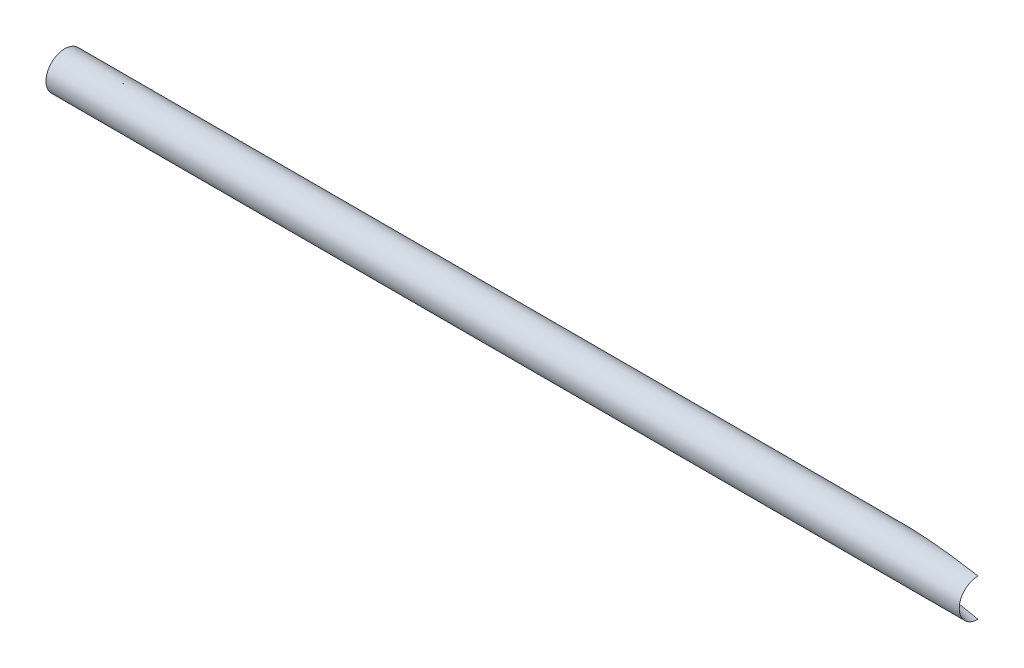
ISO-10303-21;
HEADER;
FILE_DESCRIPTION(('STEP AP214'),'2;1');
FILE_NAME('part.step','',(''),(''),'','','');
FILE_SCHEMA(('AUTOMOTIVE_DESIGN { 1 0 10303 214 1 1 1 1 }'));
ENDSEC;
DATA;
#1=APPLICATION_CONTEXT('core data for automotive mechanical design processes');
#2=APPLICATION_PROTOCOL_DEFINITION('international standard','automotive_design',2000,#1);
#3=PRODUCT_CONTEXT('',#1,'mechanical');
#4=PRODUCT('Part','Part','',(#3));
#5=PRODUCT_RELATED_PRODUCT_CATEGORY('part','',(#4));
#6=PRODUCT_DEFINITION_FORMATION('','',#4);
#7=PRODUCT_DEFINITION_CONTEXT('part definition',#1,'design');
#8=PRODUCT_DEFINITION('design','',#6,#7);
#9=PRODUCT_DEFINITION_SHAPE('','',#8);
#10=(LENGTH_UNIT() NAMED_UNIT(*) SI_UNIT(.MILLI.,.METRE.));
#11=(NAMED_UNIT(*) PLANE_ANGLE_UNIT() SI_UNIT($,.RADIAN.));
#12=(NAMED_UNIT(*) SI_UNIT($,.STERADIAN.) SOLID_ANGLE_UNIT());
#13=UNCERTAINTY_MEASURE_WITH_UNIT(LENGTH_MEASURE(1.E-05),#10,'distance_accuracy_value','');
#14=(GEOMETRIC_REPRESENTATION_CONTEXT(3) GLOBAL_UNCERTAINTY_ASSIGNED_CONTEXT((#13)) GLOBAL_UNIT_ASSIGNED_CONTEXT((#10,
#11,#12)) REPRESENTATION_CONTEXT('',''));
#15=CARTESIAN_POINT('',(0.,0.,0.));
#16=DIRECTION('',(0.,0.,1.));
#17=DIRECTION('',(1.,0.,0.));
#18=AXIS2_PLACEMENT_3D('',#15,#16,#17);
#19=CARTESIAN_POINT('',(-231.775,0.,0.));
#20=DIRECTION('',(1.,0.,0.));
#21=DIRECTION('',(0.,1.,0.));
#22=AXIS2_PLACEMENT_3D('',#19,#20,#21);
#23=CYLINDRICAL_SURFACE('',#22,6.35);
#24=CARTESIAN_POINT('',(208.553530062177,6.34999999999989,0.));
#25=CARTESIAN_POINT('',(208.215111386807,6.35000078555549,-0.103465426715095));
#26=CARTESIAN_POINT('',(207.876058761191,6.3474782800462,-0.204865751355623));
#27=CARTESIAN_POINT('',(207.196928731881,6.33791978798183,-0.403965797510251));
#28=CARTESIAN_POINT('',(206.856851295792,6.33088365723025,-0.501665400692021));
#29=CARTESIAN_POINT('',(205.835203576515,6.30364904131872,-0.78984585762347));
#30=CARTESIAN_POINT('',(205.152387117761,6.27732478872614,-0.975357080073032));
#31=CARTESIAN_POINT('',(203.784544449044,6.21063709607748,-1.33566173078402));
#32=CARTESIAN_POINT('',(203.099517916547,6.17027150566409,-1.51045351259361));
#33=CARTESIAN_POINT('',(201.727207997285,6.07667127703515,-1.85144959838024));
#34=CARTESIAN_POINT('',(201.039922800816,6.02341896307331,-2.0176417235045));
#35=CARTESIAN_POINT('',(199.664812168527,5.90461056899207,-2.34264628164214));
#36=CARTESIAN_POINT('',(198.976986853294,5.83905672209981,-2.50146004760852));
#37=CARTESIAN_POINT('',(197.601279340979,5.69557296558897,-2.81289014469089));
#38=CARTESIAN_POINT('',(196.913397152719,5.61764403672664,-2.9655069657277));
#39=CARTESIAN_POINT('',(195.7118508222,5.4700931177364,-3.22755312929091));
#40=CARTESIAN_POINT('',(195.198086424822,5.40334799922026,-3.33815057343866));
#41=CARTESIAN_POINT('',(194.171049467578,5.26207264819454,-3.55668825093245));
#42=CARTESIAN_POINT('',(193.657776916258,5.18754228278977,-3.6646284388799));
#43=CARTESIAN_POINT('',(192.632411894139,5.03002130189547,-3.87800998535029));
#44=CARTESIAN_POINT('',(192.120318831606,4.94703697848666,-3.98345313135596));
#45=CARTESIAN_POINT('',(191.097333574582,4.77151891798964,-4.19210013957637));
#46=CARTESIAN_POINT('',(190.586441319573,4.67898567318155,-4.2953041168964));
#47=CARTESIAN_POINT('',(189.565739092911,4.4827555224113,-4.49972279070746));
#48=CARTESIAN_POINT('',(189.055931144401,4.37904540683842,-4.60093496238986));
#49=CARTESIAN_POINT('',(188.038629986027,4.15837713352067,-4.80132095822046));
#50=CARTESIAN_POINT('',(187.531137292692,4.04141615676668,-4.90049434331215));
#51=CARTESIAN_POINT('',(186.772184361729,3.85344026252207,-5.04775297355612));
#52=CARTESIAN_POINT('',(186.51933962384,3.78862434846896,-5.09663511066775));
#53=CARTESIAN_POINT('',(186.014814276636,3.65423122445971,-5.19384111362586));
#54=CARTESIAN_POINT('',(185.76313362632,3.58465418357939,-5.24216499922566));
#55=CARTESIAN_POINT('',(185.261354987358,3.44001489441667,-5.33819531347796));
#56=CARTESIAN_POINT('',(185.011256344697,3.3649550990723,-5.38590200714748));
#57=CARTESIAN_POINT('',(184.512990099929,3.20832340328169,-5.48065263291774));
#58=CARTESIAN_POINT('',(184.264822317197,3.12675212019959,-5.52769662735362));
#59=CARTESIAN_POINT('',(183.852613953651,2.98394298390246,-5.6056070902747));
#60=CARTESIAN_POINT('',(183.68785784789,2.92488703347537,-5.63668513472672));
#61=CARTESIAN_POINT('',(183.359766950683,2.80264255240938,-5.69845513106541));
#62=CARTESIAN_POINT('',(183.19643245219,2.73945319181308,-5.72914700392748));
#63=CARTESIAN_POINT('',(182.871499160061,2.6081745301855,-5.79009245690659));
#64=CARTESIAN_POINT('',(182.709901805071,2.54008148083065,-5.82034568004314));
#65=CARTESIAN_POINT('',(182.389572803497,2.39823813965368,-5.88020983449781));
#66=CARTESIAN_POINT('',(182.230835008478,2.32450239946409,-5.90982218106626));
#67=CARTESIAN_POINT('',(181.916781318134,2.16993596384478,-5.96830998584013));
#68=CARTESIAN_POINT('',(181.761463461379,2.08910947514268,-5.99718586801651));
#69=CARTESIAN_POINT('',(181.532214764237,1.96113712356149,-6.03973885119984));
#70=CARTESIAN_POINT('',(181.456457970442,1.91738185557328,-6.05378932550491));
#71=CARTESIAN_POINT('',(181.306444444814,1.82728850930841,-6.08159051439045));
#72=CARTESIAN_POINT('',(181.232187538273,1.78095073423593,-6.09534126389806));
#73=CARTESIAN_POINT('',(181.083684530527,1.68409349873041,-6.12282022107892));
#74=CARTESIAN_POINT('',(181.00948606067,1.63349798658045,-6.13653908973142));
#75=CARTESIAN_POINT('',(180.863582024246,1.52864255094516,-6.16349616315376));
#76=CARTESIAN_POINT('',(180.791877173578,1.47438158808254,-6.17673422993704));
#77=CARTESIAN_POINT('',(180.651972211042,1.36171327952483,-6.20254547100456));
#78=CARTESIAN_POINT('',(180.583763366739,1.30331722964999,-6.21512030447346));
#79=CARTESIAN_POINT('',(180.451835679599,1.18148867033477,-6.23942664173118));
#80=CARTESIAN_POINT('',(180.388113999395,1.11805939851816,-6.2511586785418));
#81=CARTESIAN_POINT('',(180.297119225817,1.01834918707555,-6.26790248781666));
#82=CARTESIAN_POINT('',(180.267497916404,0.984279022639341,-6.27335136930902));
#83=CARTESIAN_POINT('',(180.210153872524,0.914539881218017,-6.28389700639921));
#84=CARTESIAN_POINT('',(180.182430351373,0.878871576975029,-6.28899390791016));
#85=CARTESIAN_POINT('',(180.129261205338,0.805850502368725,-6.29876647743572));
#86=CARTESIAN_POINT('',(180.103813765176,0.768499110753451,-6.30344248115476));
#87=CARTESIAN_POINT('',(180.055593762884,0.691985877202522,-6.31230100116032));
#88=CARTESIAN_POINT('',(180.032824991478,0.652821576318626,-6.31648281813398));
#89=CARTESIAN_POINT('',(179.97690689475,0.546885126533149,-6.32675102540611));
#90=CARTESIAN_POINT('',(179.946489975355,0.478545598324101,-6.33233430553032));
#91=CARTESIAN_POINT('',(179.909448484317,0.373024449559518,-6.33913226777076));
#92=CARTESIAN_POINT('',(179.89853513121,0.337366484457501,-6.34113484897082));
#93=CARTESIAN_POINT('',(179.879858755754,0.265214448512127,-6.3445616719974));
#94=CARTESIAN_POINT('',(179.87209401388,0.228720845564879,-6.34598622949544));
#95=CARTESIAN_POINT('',(179.859905118846,0.154773881983051,-6.3482223687043));
#96=CARTESIAN_POINT('',(179.855515930237,0.117314523546568,-6.34902753467582));
#97=CARTESIAN_POINT('',(179.850371429492,0.0421528981023721,-6.34997125034164));
#98=CARTESIAN_POINT('',(179.849614520809,0.00445074511199243,-6.35011009291466));
#99=CARTESIAN_POINT('',(179.851761471558,-0.070863391740095,-6.34971625866019));
#100=CARTESIAN_POINT('',(179.854667007041,-0.108475326420959,-6.34918327438327));
#101=CARTESIAN_POINT('',(179.864026992056,-0.183230582651983,-6.34746619162846));
#102=CARTESIAN_POINT('',(179.870481551296,-0.22037388967952,-6.34628207302258));
#103=CARTESIAN_POINT('',(179.892689093257,-0.32087256182981,-6.3422076182153));
#104=CARTESIAN_POINT('',(179.911789836192,-0.38348115791637,-6.33870284213501));
#105=CARTESIAN_POINT('',(179.958344286159,-0.505314381942772,-6.3301582944103));
#106=CARTESIAN_POINT('',(179.985800128355,-0.564538140278695,-6.32511813039354));
#107=CARTESIAN_POINT('',(180.044045290627,-0.673224126954049,-6.31442226737286));
#108=CARTESIAN_POINT('',(180.0741773366,-0.723057020933218,-6.30888760592636));
#109=CARTESIAN_POINT('',(180.138649517881,-0.819847875128244,-6.29704133583411));
#110=CARTESIAN_POINT('',(180.172992720438,-0.866803702013715,-6.29072916086079));
#111=CARTESIAN_POINT('',(180.24510515146,-0.958125120364277,-6.2774701857078));
#112=CARTESIAN_POINT('',(180.282884623192,-1.00248227332031,-6.27052148762996));
#113=CARTESIAN_POINT('',(180.361087613239,-1.08867819691548,-6.25613201153702));
#114=CARTESIAN_POINT('',(180.401510518112,-1.13051754754577,-6.24869134768449));
#115=CARTESIAN_POINT('',(180.497640957452,-1.22484886712473,-6.23098905730348));
#116=CARTESIAN_POINT('',(180.554131534664,-1.27651312583452,-6.22058091386216));
#117=CARTESIAN_POINT('',(180.66994536401,-1.37646580943263,-6.19922998529391));
#118=CARTESIAN_POINT('',(180.729269880572,-1.42475270330098,-6.18828696146597));
#119=CARTESIAN_POINT('',(180.850204826126,-1.5184513737772,-6.16596533344779));
#120=CARTESIAN_POINT('',(180.911818579952,-1.56385868685133,-6.15458609488268));
#121=CARTESIAN_POINT('',(181.0368058677,-1.65210024929482,-6.13148765228088));
#122=CARTESIAN_POINT('',(181.100179712797,-1.69493403938943,-6.11976838811283));
#123=CARTESIAN_POINT('',(181.293045970806,-1.82046792897507,-6.08407911327544));
#124=CARTESIAN_POINT('',(181.42468719791,-1.89975085571623,-6.05968758455828));
#125=CARTESIAN_POINT('',(181.691680819162,-2.05108666729656,-6.0101460064837));
#126=CARTESIAN_POINT('',(181.827029406705,-2.12314663845513,-5.98499673268457));
#127=CARTESIAN_POINT('',(182.093636249543,-2.25800933976115,-5.93538440982276));
#128=CARTESIAN_POINT('',(182.224757382951,-2.321095479572,-5.91095055516344));
#129=CARTESIAN_POINT('',(182.488931481566,-2.4429215265248,-5.86165077046332));
#130=CARTESIAN_POINT('',(182.621984675269,-2.50166091450375,-5.83678478924717));
#131=CARTESIAN_POINT('',(182.889776082891,-2.61551406178947,-5.78666221530445));
#132=CARTESIAN_POINT('',(183.024516353641,-2.67062274924148,-5.76140513457991));
#133=CARTESIAN_POINT('',(183.295211134929,-2.77763038275133,-5.71058413540296));
#134=CARTESIAN_POINT('',(183.431165710761,-2.82952915500938,-5.68502020042535));
#135=CARTESIAN_POINT('',(183.840929952895,-2.98118688448416,-5.60784707674638));
#136=CARTESIAN_POINT('',(184.116225060233,-3.07673410074653,-5.55583423417862));
#137=CARTESIAN_POINT('',(184.669613820141,-3.25898361580898,-5.45092191816286));
#138=CARTESIAN_POINT('',(184.947708256641,-3.34568335671281,-5.3980221934257));
#139=CARTESIAN_POINT('',(185.506476472726,-3.51196629549083,-5.29134828818123));
#140=CARTESIAN_POINT('',(185.787154343228,-3.59153468513061,-5.2375725501371));
#141=CARTESIAN_POINT('',(186.34968218265,-3.74441675754034,-5.12938536735158));
#142=CARTESIAN_POINT('',(186.631530213999,-3.81773824357077,-5.07497481517678));
#143=CARTESIAN_POINT('',(187.196225292739,-3.95904778031087,-4.96552313788517));
#144=CARTESIAN_POINT('',(187.479071541364,-4.0270393825501,-4.91048246116117));
#145=CARTESIAN_POINT('',(188.045640326154,-4.15838105973275,-4.79976430119458));
#146=CARTESIAN_POINT('',(188.329362645865,-4.22173219838667,-4.7440869672941));
#147=CARTESIAN_POINT('',(189.008533822952,-4.36826932955958,-4.61021326502418));
#148=CARTESIAN_POINT('',(189.404337073351,-4.44953772168821,-4.53171535971061));
#149=CARTESIAN_POINT('',(190.197048810002,-4.60518750532968,-4.37344893228518));
#150=CARTESIAN_POINT('',(190.593957333701,-4.679568660497,-4.29368036667879));
#151=CARTESIAN_POINT('',(191.388886511878,-4.82227140859363,-4.13276819188909));
#152=CARTESIAN_POINT('',(191.786907758751,-4.89058862942106,-4.05162364002473));
#153=CARTESIAN_POINT('',(192.58357654463,-5.02169189103795,-3.88794151709335));
#154=CARTESIAN_POINT('',(192.982224093698,-5.08447784202651,-3.80540392343603));
#155=CARTESIAN_POINT('',(194.179413971063,-5.26532959553519,-3.55545106769412));
#156=CARTESIAN_POINT('',(194.978648882038,-5.37579120772544,-3.38580766573746));
#157=CARTESIAN_POINT('',(196.578196089011,-5.57888539106114,-3.03953750623384));
#158=CARTESIAN_POINT('',(197.378508691732,-5.67151066139514,-2.86290792459468));
#159=CARTESIAN_POINT('',(198.977478252362,-5.83982730811565,-2.50170746835639));
#160=CARTESIAN_POINT('',(199.776135416373,-5.91555111649346,-2.31715262759666));
#161=CARTESIAN_POINT('',(201.372088010371,-6.05036782896653,-1.93805403597373));
#162=CARTESIAN_POINT('',(202.169383918002,-6.10946892587518,-1.74351526198301));
#163=CARTESIAN_POINT('',(203.363555549513,-6.18488061934896,-1.44235951756058));
#164=CARTESIAN_POINT('',(203.761208443696,-6.20780671252412,-1.34044560433851));
#165=CARTESIAN_POINT('',(204.55583387115,-6.24898309242,-1.13309189391542));
#166=CARTESIAN_POINT('',(204.952806415084,-6.26723345309763,-1.02765215251288));
#167=CARTESIAN_POINT('',(205.745753340154,-6.29869664890781,-0.81283709506555));
#168=CARTESIAN_POINT('',(206.141728000766,-6.31191109900878,-0.703463053048131));
#169=CARTESIAN_POINT('',(206.932547883366,-6.33280606628607,-0.4802293947303));
#170=CARTESIAN_POINT('',(207.327393124592,-6.34048667829269,-0.366369855330634));
#171=CARTESIAN_POINT('',(208.28947223648,-6.35169414744168,-0.0822372991516372));
#172=CARTESIAN_POINT('',(208.855954513056,-6.35189639267594,0.0907742771525044));
#173=CARTESIAN_POINT('',(209.702563940456,-6.34042777726783,0.359845270985489));
#174=CARTESIAN_POINT('',(209.984293537083,-6.33464101397099,0.45114346051996));
#175=CARTESIAN_POINT('',(210.54646491241,-6.31863623548181,0.637238295917982));
#176=CARTESIAN_POINT('',(210.82690673547,-6.30841837410482,0.732034820240423));
#177=CARTESIAN_POINT('',(211.385847905554,-6.28297285282653,0.925332668354423));
#178=CARTESIAN_POINT('',(211.664349420176,-6.26775221709241,1.02382862717244));
#179=CARTESIAN_POINT('',(212.219449239092,-6.23155665259333,1.22501058016105));
#180=CARTESIAN_POINT('',(212.496047651376,-6.21058205314366,1.32769633425182));
#181=CARTESIAN_POINT('',(213.046819912702,-6.16196969230518,1.53760701879979));
#182=CARTESIAN_POINT('',(213.320994626441,-6.1343344156342,1.64483024431778));
#183=CARTESIAN_POINT('',(213.866434409865,-6.07126005927103,1.86422426004564));
#184=CARTESIAN_POINT('',(214.137699778098,-6.03582178849216,1.97639453644615));
#185=CARTESIAN_POINT('',(214.683577856437,-5.95468952753464,2.20901448998921));
#186=CARTESIAN_POINT('',(214.958096168042,-5.90875437483536,2.32960315616993));
#187=CARTESIAN_POINT('',(215.502313562413,-5.80527056261903,2.57668054599995));
#188=CARTESIAN_POINT('',(215.772012253689,-5.74772096430216,2.70316974595565));
#189=CARTESIAN_POINT('',(216.305169273666,-5.61864225232948,2.96214465202205));
#190=CARTESIAN_POINT('',(216.568627488808,-5.54711288449716,3.09463046712798));
#191=CARTESIAN_POINT('',(217.087372181763,-5.38718640409342,3.36533076011014));
#192=CARTESIAN_POINT('',(217.342660914771,-5.2987939943173,3.5035436324219));
#193=CARTESIAN_POINT('',(217.778289465893,-5.1270154702325,3.7486607628024));
#194=CARTESIAN_POINT('',(217.96102884193,-5.04818150542292,3.8544819847875));
#195=CARTESIAN_POINT('',(218.319301741015,-4.87767261607161,4.0681072359221));
#196=CARTESIAN_POINT('',(218.494834724427,-4.78599673214762,4.17591141268918));
#197=CARTESIAN_POINT('',(218.836749495559,-4.5883143783183,4.39218588309298));
#198=CARTESIAN_POINT('',(219.003146400799,-4.48233265138888,4.50065472458707));
#199=CARTESIAN_POINT('',(219.325130279914,-4.2543186683316,4.71677028106653));
#200=CARTESIAN_POINT('',(219.480722022691,-4.13229356270371,4.82441733983556));
#201=CARTESIAN_POINT('',(219.733229375153,-3.9108715587629,5.00412055250464));
#202=CARTESIAN_POINT('',(219.83352910052,-3.81597892472311,5.07698639764107));
#203=CARTESIAN_POINT('',(220.027029863083,-3.61751113698851,5.220257190167));
#204=CARTESIAN_POINT('',(220.120232781202,-3.51393829927237,5.29066278692035));
#205=CARTESIAN_POINT('',(220.298639210098,-3.29802875106883,5.42787745494789));
#206=CARTESIAN_POINT('',(220.383848358742,-3.18569832111379,5.49468904660685));
#207=CARTESIAN_POINT('',(220.545470207413,-2.9522963836697,5.62354017423035));
#208=CARTESIAN_POINT('',(220.621884180422,-2.83122614528766,5.6855804003531));
#209=CARTESIAN_POINT('',(220.754128316951,-2.59986087974894,5.79456508432719));
#210=CARTESIAN_POINT('',(220.811319512595,-2.49074681761677,5.84236756878969));
#211=CARTESIAN_POINT('',(220.918302390313,-2.2669042233321,5.93280786834791));
#212=CARTESIAN_POINT('',(220.968095437278,-2.1521767320105,5.97544663583287));
#213=CARTESIAN_POINT('',(221.059851429921,-1.91764572794419,6.05478798966892));
#214=CARTESIAN_POINT('',(221.101814744032,-1.79784245436852,6.09149085532588));
#215=CARTESIAN_POINT('',(221.177535617744,-1.55385714968122,6.15824831594412));
#216=CARTESIAN_POINT('',(221.211293050248,-1.4296750507822,6.18830280793135));
#217=CARTESIAN_POINT('',(221.270422299942,-1.17721463250369,6.24126381762115));
#218=CARTESIAN_POINT('',(221.295755639499,-1.04892037467842,6.2641375106569));
#219=CARTESIAN_POINT('',(221.337587867146,-0.789753019367523,6.30205841929722));
#220=CARTESIAN_POINT('',(221.354086653592,-0.658879892228955,6.31710554485397));
#221=CARTESIAN_POINT('',(221.378090864013,-0.395653969409275,6.33903756176257));
#222=CARTESIAN_POINT('',(221.385597844119,-0.263301433759038,6.34592386543299));
#223=CARTESIAN_POINT('',(221.391551474147,0.00177390250346007,6.35138306756668));
#224=CARTESIAN_POINT('',(221.389998719697,0.134496678200998,6.34995651255585));
#225=CARTESIAN_POINT('',(221.378338292674,0.388549223005831,6.33927257668342));
#226=CARTESIAN_POINT('',(221.368926843164,0.509938885484658,6.33065252386731));
#227=CARTESIAN_POINT('',(221.342525943632,0.751248447608498,6.30657052993483));
#228=CARTESIAN_POINT('',(221.32553390867,0.871167831551912,6.2911062549882));
#229=CARTESIAN_POINT('',(221.284118912342,1.10860194338913,6.25363414252508));
#230=CARTESIAN_POINT('',(221.259700126411,1.22611798296111,6.23162998199121));
#231=CARTESIAN_POINT('',(221.203612584764,1.45810688185645,6.18146539659568));
#232=CARTESIAN_POINT('',(221.171941163108,1.57257860483005,6.15330270813955));
#233=CARTESIAN_POINT('',(221.101213283498,1.79901721940387,6.09097527322665));
#234=CARTESIAN_POINT('',(221.062079057099,1.91094243201847,6.05674761785377));
#235=CARTESIAN_POINT('',(220.976952079613,2.13042553686196,5.98307567586648));
#236=CARTESIAN_POINT('',(220.930956645766,2.23798169974977,5.94362934941441));
#237=CARTESIAN_POINT('',(220.832469183267,2.44822930126289,5.86015929889814));
#238=CARTESIAN_POINT('',(220.779976956327,2.5509205912753,5.81613543512969));
#239=CARTESIAN_POINT('',(220.668880630975,2.75111560441284,5.72415971630975));
#240=CARTESIAN_POINT('',(220.610275338171,2.84861830813301,5.67620709403803));
#241=CARTESIAN_POINT('',(220.463759045153,3.07461840918061,5.55797953289588));
#242=CARTESIAN_POINT('',(220.37323445574,3.20064572019811,5.48620197152585));
#243=CARTESIAN_POINT('',(220.182389849932,3.44211545694583,5.33801735158706));
#244=CARTESIAN_POINT('',(220.082066796151,3.55755457884688,5.2616088602987));
#245=CARTESIAN_POINT('',(219.872652175459,3.77808144608577,5.10557224823661));
#246=CARTESIAN_POINT('',(219.763551046563,3.8831576180617,5.02594066475545));
#247=CARTESIAN_POINT('',(219.53773927793,4.08323097955725,4.8647950367348));
#248=CARTESIAN_POINT('',(219.421026144005,4.17822483839545,4.78328038088583));
#249=CARTESIAN_POINT('',(219.119619652634,4.40483645795524,4.57754026296426));
#250=CARTESIAN_POINT('',(218.930680557444,4.53034539907554,4.45278735385439));
#251=CARTESIAN_POINT('',(218.540757290223,4.76200442081948,4.20413096901711));
#252=CARTESIAN_POINT('',(218.339766258289,4.8681433344545,4.08022802266238));
#253=CARTESIAN_POINT('',(217.927785632994,5.06378552788288,3.83474444675838));
#254=CARTESIAN_POINT('',(217.716772728355,5.15324737282773,3.71317025751983));
#255=CARTESIAN_POINT('',(217.287244175333,5.31760603155993,3.47370868846166));
#256=CARTESIAN_POINT('',(217.068729931014,5.39250555374979,3.3558206264996));
#257=CARTESIAN_POINT('',(216.659919849005,5.51929705067353,3.14210227615614));
#258=CARTESIAN_POINT('',(216.470474750116,5.57295583882478,3.04567606655973));
#259=CARTESIAN_POINT('',(216.088016908223,5.67254111504785,2.85591679137549));
#260=CARTESIAN_POINT('',(215.895003704283,5.71846659625702,2.76258412983062));
#261=CARTESIAN_POINT('',(215.505766809292,5.8036185364837,2.57890950184896));
#262=CARTESIAN_POINT('',(215.309538987957,5.84283549127777,2.48857192226546));
#263=CARTESIAN_POINT('',(214.914610929037,5.9153342901533,2.31095340720514));
#264=CARTESIAN_POINT('',(214.715910467314,5.94861559193159,2.223672751605));
#265=CARTESIAN_POINT('',(214.116457649435,6.04070710799491,1.96614575015295));
#266=CARTESIAN_POINT('',(213.712592842653,6.09171474667796,1.80032641523277));
#267=CARTESIAN_POINT('',(212.898112717764,6.17759823220241,1.47899651048699));
#268=CARTESIAN_POINT('',(212.487483992567,6.21243664800287,1.32351056730318));
#269=CARTESIAN_POINT('',(211.662326323599,6.26907145053743,1.02211421873431));
#270=CARTESIAN_POINT('',(211.24780157442,6.29088052434135,0.876194622000091));
#271=CARTESIAN_POINT('',(210.41563759664,6.32389864764708,0.592596189230343));
#272=CARTESIAN_POINT('',(209.997998994508,6.33510977426455,0.454915743341936));
#273=CARTESIAN_POINT('',(209.40849785752,6.34465396747801,0.266168339405693));
#274=CARTESIAN_POINT('',(209.237633515491,6.34668153896753,0.21211827462366));
#275=CARTESIAN_POINT('',(208.895743257594,6.34935354530932,0.105203545915352));
#276=CARTESIAN_POINT('',(208.724717767509,6.3499996026298,0.0523375637030099));
#277=CARTESIAN_POINT('',(208.553530062177,6.34999999999989,0.));
#278=B_SPLINE_CURVE_WITH_KNOTS('',3,(#24,#25,#26,#27,#28,#29,#30,#31,#32,#33,#34,#35,#36,#37,
#38,#39,#40,#41,#42,#43,#44,#45,#46,#47,#48,#49,#50,#51,#52,#53,#54,#55,#56,#57,#58,#59,#60,#61,
#62,#63,#64,#65,#66,#67,#68,#69,#70,#71,#72,#73,#74,#75,#76,#77,#78,#79,#80,#81,#82,#83,#84,#85,
#86,#87,#88,#89,#90,#91,#92,#93,#94,#95,#96,#97,#98,#99,#100,#101,#102,#103,#104,#105,#106,#107,
#108,#109,#110,#111,#112,#113,#114,#115,#116,#117,#118,#119,#120,#121,#122,#123,#124,#125,#126,
#127,#128,#129,#130,#131,#132,#133,#134,#135,#136,#137,#138,#139,#140,#141,#142,#143,#144,#145,
#146,#147,#148,#149,#150,#151,#152,#153,#154,#155,#156,#157,#158,#159,#160,#161,#162,#163,#164,
#165,#166,#167,#168,#169,#170,#171,#172,#173,#174,#175,#176,#177,#178,#179,#180,#181,#182,#183,
#184,#185,#186,#187,#188,#189,#190,#191,#192,#193,#194,#195,#196,#197,#198,#199,#200,#201,#202,
#203,#204,#205,#206,#207,#208,#209,#210,#211,#212,#213,#214,#215,#216,#217,#218,#219,#220,#221,
#222,#223,#224,#225,#226,#227,#228,#229,#230,#231,#232,#233,#234,#235,#236,#237,#238,#239,#240,
#241,#242,#243,#244,#245,#246,#247,#248,#249,#250,#251,#252,#253,#254,#255,#256,#257,#258,#259,
#260,#261,#262,#263,#264,#265,#266,#267,#268,#269,#270,#271,#272,#273,#274,#275,#276,#277),
.UNSPECIFIED.,.T.,.F.,(4,2,2,2,2,2,2,2,2,2,2,2,2,2,2,2,2,2,2,2,2,2,2,2,2,2,2,2,2,2,2,2,2,2,2,2,
2,2,2,2,2,2,2,2,2,2,2,2,2,2,2,2,2,2,2,2,2,2,2,2,2,2,2,2,2,2,2,2,2,2,2,2,2,2,2,2,2,2,2,2,2,2,2,2,
2,2,2,2,2,2,2,2,2,2,2,2,2,2,2,2,2,2,2,2,2,2,2,2,2,2,2,2,2,2,2,2,2,2,2,2,2,2,2,2,2,2,4),(0.,
1.06163700607078,2.12330792988308,4.24718004741806,6.37137756813801,8.49850537128201,
10.6252473873847,12.7518209378933,14.3410295507077,15.9302652959556,17.5183267344489,
19.1063063437114,20.6961837591829,22.2864000450791,23.0830380436995,23.8796477669964,
24.6759032513228,25.4720833309097,26.0053144744056,26.5386530172961,27.072403656195,
27.6048214363298,28.1369254579257,28.402703614624,28.6684506325965,28.9409088291569,
29.2134446110805,29.4852626697892,29.7569072770484,29.8932733864349,30.0295826216955,
30.1657821562822,30.3021721727363,30.5262131506935,30.6381269162113,30.7499794806185,
30.8629755848131,30.9759220176513,31.0889201571558,31.2019217898778,31.3977676915723,
31.5936636842364,31.7688926110873,31.9442499349292,32.1201482813932,32.2960059522583,
32.5276126732603,32.7593237142471,32.9913855598591,33.2234886973088,33.6899532883925,
34.1559556651593,34.5984975158041,35.0410921372943,35.4842924700093,35.9275167786891,
36.8153334754904,37.7034061263514,38.5932820844504,39.4820296468812,40.3701798738669,
41.2581258733126,42.4928950458056,43.7277065755023,44.963401293712,46.199116069893,
48.672267888561,51.1464298814319,53.6158026219732,56.0839561447685,57.3173557570746,
58.5507358592718,59.7837200947369,61.0166832007328,62.7932784307755,63.6818644021532,
64.570419530789,65.4577323713512,66.3449944391317,67.2319260310658,68.1187657206779,
69.0285020915039,69.9383120261201,70.8481385042005,71.7577116181857,72.4335123566844,
73.1093636092348,73.7840605589692,74.4584578106897,74.926456430441,75.394330577875,
75.8618722211238,76.3293461087226,76.7253777100158,77.1213361561504,77.5172759655693,
77.9132219071158,78.3109522835355,78.708687235902,79.1063533458727,79.5039933117242,
79.869736624305,80.2356047489152,80.6012675558669,80.9670649903996,81.3369061804048,
81.7068923608249,82.0768898363622,82.4469597391743,82.9590916971059,83.4713829156063,
83.9842399327081,84.4972658476844,85.2726069616657,86.048393664121,86.8260828729865,
87.6036273031259,88.261150152333,88.9187585437507,89.5772910135674,90.2358836185538,
91.5538735239549,92.8748994840223,94.1946370151408,95.5141158342541,96.0517723579944,
96.5887971033501),.UNSPECIFIED.);
#279=CARTESIAN_POINT('',(208.553530062177,6.34999999999989,0.));
#280=VERTEX_POINT('',#279);
#281=EDGE_CURVE('E61',#280,#280,#278,.T.);
#282=ORIENTED_EDGE('',*,*,#281,.F.);
#283=EDGE_LOOP('',(#282));
#284=FACE_BOUND('',#283,.T.);
#285=CARTESIAN_POINT('',(-231.775,0.,0.));
#286=DIRECTION('',(-1.,0.,0.));
#287=DIRECTION('',(0.,-1.,0.));
#288=AXIS2_PLACEMENT_3D('',#285,#286,#287);
#289=CIRCLE('',#288,6.35);
#290=CARTESIAN_POINT('',(-231.775,-6.35000000000006,0.));
#291=VERTEX_POINT('',#290);
#292=EDGE_CURVE('E51',#291,#291,#289,.T.);
#293=ORIENTED_EDGE('',*,*,#292,.T.);
#294=EDGE_LOOP('',(#293));
#295=FACE_BOUND('',#294,.T.);
#296=ADVANCED_FACE('F42',(#284,#295),#23,.F.);
#297=CARTESIAN_POINT('',(-231.775,0.,0.));
#298=DIRECTION('',(1.,0.,0.));
#299=DIRECTION('',(0.,1.,0.));
#300=AXIS2_PLACEMENT_3D('',#297,#298,#299);
#301=CYLINDRICAL_SURFACE('',#300,9.525);
#302=CARTESIAN_POINT('',(-231.775,0.,0.));
#303=DIRECTION('',(-1.,0.,0.));
#304=DIRECTION('',(0.,-1.,0.));
#305=AXIS2_PLACEMENT_3D('',#302,#303,#304);
#306=CIRCLE('',#305,9.525);
#307=CARTESIAN_POINT('',(-231.775,-9.52500000000006,0.));
#308=VERTEX_POINT('',#307);
#309=EDGE_CURVE('E12',#308,#308,#306,.T.);
#310=ORIENTED_EDGE('',*,*,#309,.F.);
#311=EDGE_LOOP('',(#310));
#312=FACE_BOUND('',#311,.T.);
#313=CARTESIAN_POINT('',(231.775,0.,0.));
#314=DIRECTION('',(-1.,0.,0.));
#315=DIRECTION('',(0.,-1.,0.));
#316=AXIS2_PLACEMENT_3D('',#313,#314,#315);
#317=CIRCLE('',#316,9.525);
#318=CARTESIAN_POINT('',(231.775,-9.52499999999992,0.));
#319=VERTEX_POINT('',#318);
#320=CARTESIAN_POINT('',(231.775,9.52500000000009,0.));
#321=VERTEX_POINT('',#320);
#322=EDGE_CURVE('E46',#319,#321,#317,.T.);
#323=ORIENTED_EDGE('',*,*,#322,.T.);
#324=CARTESIAN_POINT('',(231.775,9.52500000000009,0.));
#325=CARTESIAN_POINT('',(231.762447733154,9.52499999932211,-0.00191880654846267));
#326=CARTESIAN_POINT('',(231.74989546544,9.52499941951994,-0.00383761322942119));
#327=CARTESIAN_POINT('',(230.301808389539,9.52486571635476,-0.225199937500764));
#328=CARTESIAN_POINT('',(228.866263057003,9.51715819170772,-0.44464506388536));
#329=CARTESIAN_POINT('',(225.995317536362,9.48648608549445,-0.883513129109154));
#330=CARTESIAN_POINT('',(224.55991735048,9.46352129785681,-1.10293606760864));
#331=CARTESIAN_POINT('',(221.689414722901,9.4020083099061,-1.54173642983908));
#332=CARTESIAN_POINT('',(220.254312286923,9.36345983384378,-1.76111385269593));
#333=CARTESIAN_POINT('',(217.38463408153,9.27021277821046,-2.19978818934658));
#334=CARTESIAN_POINT('',(215.950058306396,9.21551437952257,-2.41908510401454));
#335=CARTESIAN_POINT('',(213.081922209958,9.0891270938479,-2.85752370565467));
#336=CARTESIAN_POINT('',(211.648361742851,9.01744161081702,-3.07666541491506));
#337=CARTESIAN_POINT('',(208.782259536634,8.85586738826341,-3.51479310523348));
#338=CARTESIAN_POINT('',(207.349717781813,8.76597893587046,-3.73377908869324));
#339=CARTESIAN_POINT('',(204.485901982265,8.56630761581095,-4.17155726667706));
#340=CARTESIAN_POINT('',(203.054628014073,8.45652361972414,-4.39034944950163));
#341=CARTESIAN_POINT('',(200.193901299358,8.21473567118305,-4.8276554134804));
#342=CARTESIAN_POINT('',(198.764448538857,8.08273189032342,-5.04616919677145));
#343=CARTESIAN_POINT('',(196.622107729198,7.86552697777017,-5.37365885459725));
#344=CARTESIAN_POINT('',(195.908262896669,7.78992097068929,-5.48278098814894));
#345=CARTESIAN_POINT('',(194.481329264531,7.63173792028465,-5.70090968402407));
#346=CARTESIAN_POINT('',(193.76824046032,7.54916091964573,-5.80991624705104));
#347=CARTESIAN_POINT('',(192.342912417298,7.37635367106345,-6.02779950399843));
#348=CARTESIAN_POINT('',(191.630673246988,7.28612284343772,-6.13667618744769));
#349=CARTESIAN_POINT('',(190.207296789832,7.09716556072345,-6.35426111455911));
#350=CARTESIAN_POINT('',(189.496159497602,6.99843914729002,-6.4629693590445));
#351=CARTESIAN_POINT('',(188.074897066081,6.79136799620669,-6.68023112489595));
#352=CARTESIAN_POINT('',(187.364772583464,6.68301862527867,-6.78878454587944));
#353=CARTESIAN_POINT('',(185.946249771437,6.45534869366671,-7.00562751887233));
#354=CARTESIAN_POINT('',(185.237851414883,6.33602830665771,-7.11391707503095));
#355=CARTESIAN_POINT('',(183.823266032143,6.08456712381935,-7.33015815156309));
#356=CARTESIAN_POINT('',(183.11707898688,5.95242643889886,-7.43810967485262));
#357=CARTESIAN_POINT('',(182.060060903677,5.74265405552897,-7.59969110429672));
#358=CARTESIAN_POINT('',(181.708105233306,5.67080449770403,-7.65349292776941));
#359=CARTESIAN_POINT('',(181.00507757876,5.522813997312,-7.7609614897241));
#360=CARTESIAN_POINT('',(180.654005585722,5.4466730979579,-7.81462822956069));
#361=CARTESIAN_POINT('',(179.923122052765,5.28291278092427,-7.92635498985983));
#362=CARTESIAN_POINT('',(179.54340338499,5.19486777115559,-7.9844008133905));
#363=CARTESIAN_POINT('',(178.785478817196,5.01229381134345,-8.10026121069338));
#364=CARTESIAN_POINT('',(178.407272945678,4.91776473974905,-8.15807578010895));
#365=CARTESIAN_POINT('',(177.652856901352,4.72117237772953,-8.27339984577634));
#366=CARTESIAN_POINT('',(177.276646326599,4.61911067170702,-8.33090940347152));
#367=CARTESIAN_POINT('',(176.526719405334,4.40602104808875,-8.44554723781376));
#368=CARTESIAN_POINT('',(176.153002907198,4.29499368102322,-8.50267553763885));
#369=CARTESIAN_POINT('',(175.518523802724,4.09630599751279,-8.5996654021268));
#370=CARTESIAN_POINT('',(175.256919995355,4.01139790595322,-8.63965555727355));
#371=CARTESIAN_POINT('',(174.735833171183,3.83517820983432,-8.71931167220036));
#372=CARTESIAN_POINT('',(174.476350033436,3.74386697333534,-8.7589776504684));
#373=CARTESIAN_POINT('',(173.959938803438,3.55351113534802,-8.83791902910062));
#374=CARTESIAN_POINT('',(173.703012747612,3.45446085186962,-8.87719411816596));
#375=CARTESIAN_POINT('',(173.192911551971,3.2469761167225,-8.95517091124345));
#376=CARTESIAN_POINT('',(172.939735649266,3.13854360525349,-8.99387273187518));
#377=CARTESIAN_POINT('',(172.505797002462,2.94041741396908,-9.0602069109746));
#378=CARTESIAN_POINT('',(172.32380694818,2.85348686558027,-9.08802688263164));
#379=CARTESIAN_POINT('',(171.963574199709,2.67179429836172,-9.14309398446847));
#380=CARTESIAN_POINT('',(171.785333015031,2.57702919785183,-9.17034088389636));
#381=CARTESIAN_POINT('',(171.434024893954,2.37767716388353,-9.22404371952584));
#382=CARTESIAN_POINT('',(171.260961988859,2.27308282781654,-9.25049903948096));
#383=CARTESIAN_POINT('',(171.007452980259,2.10680713967465,-9.28925178045827));
#384=CARTESIAN_POINT('',(170.923986765811,2.04983517784049,-9.30201087176905));
#385=CARTESIAN_POINT('',(170.759591399396,1.93227382843161,-9.32714122547045));
#386=CARTESIAN_POINT('',(170.678661727629,1.87168518949135,-9.33951256732031));
#387=CARTESIAN_POINT('',(170.519175324096,1.7456534678105,-9.3638925107383));
#388=CARTESIAN_POINT('',(170.440652854016,1.68016572237726,-9.37589587488179));
#389=CARTESIAN_POINT('',(170.287904277117,1.54420299973838,-9.39924583813545));
#390=CARTESIAN_POINT('',(170.213678202485,1.47372798517771,-9.4105924323252));
#391=CARTESIAN_POINT('',(170.071429235517,1.32743189281014,-9.43233736912891));
#392=CARTESIAN_POINT('',(170.003370948893,1.25164642007445,-9.44274112230278));
#393=CARTESIAN_POINT('',(169.875008848557,1.09346106243474,-9.46236323850825));
#394=CARTESIAN_POINT('',(169.814708059408,1.01105861786177,-9.47158113918912));
#395=CARTESIAN_POINT('',(169.709841912858,0.846782270535838,-9.48761153841227));
#396=CARTESIAN_POINT('',(169.664351139166,0.76552147166826,-9.49456550103164));
#397=CARTESIAN_POINT('',(169.585441599935,0.597249404007003,-9.50662803463208));
#398=CARTESIAN_POINT('',(169.55199305669,0.510252957944499,-9.51174115759251));
#399=CARTESIAN_POINT('',(169.513074476706,0.37583478216585,-9.51769045958254));
#400=CARTESIAN_POINT('',(169.501941704748,0.330056654029375,-9.51939227456123));
#401=CARTESIAN_POINT('',(169.483924726488,0.237660842116603,-9.52214644608172));
#402=CARTESIAN_POINT('',(169.477038381049,0.191043593248735,-9.52319912962361));
#403=CARTESIAN_POINT('',(169.467761161868,0.0973822340241415,-9.52461729489475));
#404=CARTESIAN_POINT('',(169.465367382523,0.0503384193520408,-9.52498322079002));
#405=CARTESIAN_POINT('',(169.465155285163,-0.0437592936603761,-9.5250156431253));
#406=CARTESIAN_POINT('',(169.467336725753,-0.0908131913377264,-9.52468217646617));
#407=CARTESIAN_POINT('',(169.475688096274,-0.179154186269673,-9.52340554136598));
#408=CARTESIAN_POINT('',(169.481376526691,-0.220488882442103,-9.52253597751205));
#409=CARTESIAN_POINT('',(169.496118212289,-0.302545548668441,-9.52028248472008));
#410=CARTESIAN_POINT('',(169.505172531267,-0.343267320768148,-9.51889839316445));
#411=CARTESIAN_POINT('',(169.537057103043,-0.464175990160267,-9.51402434723596));
#412=CARTESIAN_POINT('',(169.564609170604,-0.543108177635521,-9.50981259104036));
#413=CARTESIAN_POINT('',(169.646486175244,-0.73510691441154,-9.49729643482817));
#414=CARTESIAN_POINT('',(169.707305504368,-0.845306116407994,-9.48799926735874));
#415=CARTESIAN_POINT('',(169.810331755916,-1.0024431247639,-9.47225012431178));
#416=CARTESIAN_POINT('',(169.846711788858,-1.05354148544267,-9.46668887818045));
#417=CARTESIAN_POINT('',(169.922741385245,-1.15319141182238,-9.45506658802321));
#418=CARTESIAN_POINT('',(169.962390420472,-1.20174338691196,-9.44900562474356));
#419=CARTESIAN_POINT('',(170.082431547372,-1.34047824143652,-9.43065549697855));
#420=CARTESIAN_POINT('',(170.166457570805,-1.42743739059458,-9.41781083027637));
#421=CARTESIAN_POINT('',(170.341427309823,-1.5939409033932,-9.39106402150399));
#422=CARTESIAN_POINT('',(170.432377954489,-1.67347765797742,-9.37716082021756));
#423=CARTESIAN_POINT('',(170.619500763282,-1.82652534822397,-9.34855622829317));
#424=CARTESIAN_POINT('',(170.715687212149,-1.90001826823791,-9.33385265401357));
#425=CARTESIAN_POINT('',(170.911699626307,-2.04169208016842,-9.30388914953616));
#426=CARTESIAN_POINT('',(171.011523604178,-2.10987581080986,-9.28862952314615));
#427=CARTESIAN_POINT('',(171.223599965138,-2.24804268793777,-9.25621039796702));
#428=CARTESIAN_POINT('',(171.33613298244,-2.31758286784645,-9.23900799993329));
#429=CARTESIAN_POINT('',(171.56381246885,-2.45215950292144,-9.20420369766613));
#430=CARTESIAN_POINT('',(171.67895942445,-2.51719511044437,-9.18660171906496));
#431=CARTESIAN_POINT('',(171.911501425231,-2.64351015355711,-9.15105410688199));
#432=CARTESIAN_POINT('',(172.028900055826,-2.70478280826314,-9.13310792521462));
#433=CARTESIAN_POINT('',(172.265357692398,-2.82396566759022,-9.09696174803182));
#434=CARTESIAN_POINT('',(172.384416832801,-2.88187559799882,-9.0787617319672));
#435=CARTESIAN_POINT('',(172.744134147645,-3.05144732534554,-9.02377342206821));
#436=CARTESIAN_POINT('',(172.986833157596,-3.15868531811008,-8.98667315521877));
#437=CARTESIAN_POINT('',(173.476087161337,-3.36390475458248,-8.91188317522991));
#438=CARTESIAN_POINT('',(173.722643626769,-3.4618825598917,-8.87419323712733));
#439=CARTESIAN_POINT('',(174.220084974369,-3.65083316357273,-8.79815169603359));
#440=CARTESIAN_POINT('',(174.470987153125,-3.7417591613933,-8.75979744899358));
#441=CARTESIAN_POINT('',(174.974511723767,-3.91705194004569,-8.68282599394062));
#442=CARTESIAN_POINT('',(175.227130283286,-4.00143004950808,-8.64420937176379));
#443=CARTESIAN_POINT('',(175.73386139473,-4.1646862269663,-8.5667477477538));
#444=CARTESIAN_POINT('',(175.987972534237,-4.24356879731445,-8.52790296183026));
#445=CARTESIAN_POINT('',(176.497539329165,-4.39663051311148,-8.45000786009957));
#446=CARTESIAN_POINT('',(176.752994831126,-4.47081018330267,-8.41095756775095));
#447=CARTESIAN_POINT('',(177.343244966744,-4.63708775638827,-8.32072877965406));
#448=CARTESIAN_POINT('',(177.678438003355,-4.72773719502686,-8.26948938190252));
#449=CARTESIAN_POINT('',(178.350497650536,-4.90306644057348,-8.16675475494575));
#450=CARTESIAN_POINT('',(178.687364938666,-4.98774357658273,-8.11525942216517));
#451=CARTESIAN_POINT('',(179.362385511461,-5.15186566843663,-8.01207217230558));
#452=CARTESIAN_POINT('',(179.700538956628,-5.23130994698164,-7.96038023069136));
#453=CARTESIAN_POINT('',(180.376298097052,-5.38520782271132,-7.85708007943943));
#454=CARTESIAN_POINT('',(180.713899021039,-5.45968291955666,-7.80547259916361));
#455=CARTESIAN_POINT('',(181.389909383176,-5.60452225639518,-7.70213404481894));
#456=CARTESIAN_POINT('',(181.728318698619,-5.67488708355924,-7.65040298950778));
#457=CARTESIAN_POINT('',(182.405853027123,-5.81191250014871,-7.5468314735252));
#458=CARTESIAN_POINT('',(182.744978010976,-5.87857323782514,-7.49499101731873));
#459=CARTESIAN_POINT('',(183.764087715249,-6.07367110180462,-7.3392044651345));
#460=CARTESIAN_POINT('',(184.445020409955,-6.19705706765017,-7.23511345674446));
#461=CARTESIAN_POINT('',(185.808856540145,-6.43247848892876,-7.026630182004));
#462=CARTESIAN_POINT('',(186.491760172938,-6.54451276433391,-6.92223788549185));
#463=CARTESIAN_POINT('',(187.85909456753,-6.75874970827106,-6.71321984737156));
#464=CARTESIAN_POINT('',(188.543525386181,-6.86095200433483,-6.60859409707292));
#465=CARTESIAN_POINT('',(189.91483441904,-7.05687167546117,-6.39896847451971));
#466=CARTESIAN_POINT('',(190.601714820623,-7.15057331865039,-6.29396826789141));
#467=CARTESIAN_POINT('',(191.976432573801,-7.33020078792544,-6.08382157014513));
#468=CARTESIAN_POINT('',(192.664269878481,-7.41612698247151,-5.97867508619889));
#469=CARTESIAN_POINT('',(194.040757609612,-7.58094164087881,-5.7682578201698));
#470=CARTESIAN_POINT('',(194.729408027665,-7.65983017679585,-5.66298703937077));
#471=CARTESIAN_POINT('',(196.450390324147,-7.84884592020325,-5.39990849422979));
#472=CARTESIAN_POINT('',(197.48315231806,-7.9549742781496,-5.24203498013783));
#473=CARTESIAN_POINT('',(199.549888416514,-8.1543856372822,-4.92610266225052));
#474=CARTESIAN_POINT('',(200.583862532564,-8.24766851548399,-4.76804385669577));
#475=CARTESIAN_POINT('',(202.652140346031,-8.42253185385258,-4.45187586401568));
#476=CARTESIAN_POINT('',(203.686443458682,-8.50411941035217,-4.29376676628087));
#477=CARTESIAN_POINT('',(205.755823024296,-8.6565856509254,-3.97743035388479));
#478=CARTESIAN_POINT('',(206.79089948286,-8.72746425668005,-3.81920303836746));
#479=CARTESIAN_POINT('',(209.650803095699,-8.90948651744849,-3.38202289814064));
#480=CARTESIAN_POINT('',(211.476288719127,-9.01014652772504,-3.10296941631782));
#481=CARTESIAN_POINT('',(215.128824049845,-9.18345662889066,-2.54462335845991));
#482=CARTESIAN_POINT('',(216.955873958319,-9.25610230221504,-2.26533075167086));
#483=CARTESIAN_POINT('',(220.941645231273,-9.38600089614003,-1.65604446796511));
#484=CARTESIAN_POINT('',(223.100531171555,-9.43808626957466,-1.32602563311368));
#485=CARTESIAN_POINT('',(227.418737741358,-9.50748436228627,-0.665921514466244));
#486=CARTESIAN_POINT('',(229.578058339796,-9.5247990271997,-0.335836235421952));
#487=CARTESIAN_POINT('',(231.749895465843,-9.52499941873312,-0.00383761316738087));
#488=CARTESIAN_POINT('',(231.762447733556,-9.52499999852965,-0.00191880648666765));
#489=CARTESIAN_POINT('',(231.775,-9.52499999999992,0.));
#490=B_SPLINE_CURVE_WITH_KNOTS('',3,(#324,#325,#326,#327,#328,#329,#330,#331,#332,#333,#334,
#335,#336,#337,#338,#339,#340,#341,#342,#343,#344,#345,#346,#347,#348,#349,#350,#351,#352,#353,
#354,#355,#356,#357,#358,#359,#360,#361,#362,#363,#364,#365,#366,#367,#368,#369,#370,#371,#372,
#373,#374,#375,#376,#377,#378,#379,#380,#381,#382,#383,#384,#385,#386,#387,#388,#389,#390,#391,
#392,#393,#394,#395,#396,#397,#398,#399,#400,#401,#402,#403,#404,#405,#406,#407,#408,#409,#410,
#411,#412,#413,#414,#415,#416,#417,#418,#419,#420,#421,#422,#423,#424,#425,#426,#427,#428,#429,
#430,#431,#432,#433,#434,#435,#436,#437,#438,#439,#440,#441,#442,#443,#444,#445,#446,#447,#448,
#449,#450,#451,#452,#453,#454,#455,#456,#457,#458,#459,#460,#461,#462,#463,#464,#465,#466,#467,
#468,#469,#470,#471,#472,#473,#474,#475,#476,#477,#478,#479,#480,#481,#482,#483,#484,#485,#486,
#487,#488,#489),.UNSPECIFIED.,.F.,.F.,(4,2,2,2,2,2,2,2,2,2,2,2,2,2,2,2,2,2,2,2,2,2,2,2,2,2,2,2,
2,2,2,2,2,2,2,2,2,2,2,2,2,2,2,2,2,2,2,2,2,2,2,2,2,2,2,2,2,2,2,2,2,2,2,2,2,2,2,2,2,2,2,2,2,2,2,2,
2,2,2,2,2,2,4),(0.,0.0380942409377936,4.39472577327182,8.75141614940996,13.1081836194051,
17.4649022943838,21.820748685699,26.1765263741659,30.5325511876637,34.8885423628407,
37.0667678326013,39.244979965604,41.4233572186862,43.6017237914723,45.7811449536488,
47.9605316207802,50.1398994356368,51.2295422837254,52.3191741612734,53.5013979243168,
54.6836438555163,55.8656418197783,57.0475672593803,57.8812922344861,58.7149693253127,
59.5492643578151,60.3833872725735,60.9940270728586,61.6049082184536,62.2162531762056,
62.5217542879677,62.8271923803185,63.1358692568202,63.4445484455813,63.7513262150023,
64.0582232334905,64.3376455421711,64.6163720785904,64.7576289193526,64.8988145436999,
65.0399088236021,65.1809956593747,65.3060469849108,65.431137866838,65.6813138581281,
66.0576942510429,66.2465257589015,66.4353268142041,66.7995104278029,67.1640633740923,
67.5296663217139,67.8950724264248,68.2951446731115,68.6952919996037,69.0961404287561,
69.4970214992165,70.3004931858334,71.1042792615608,71.9130099915679,72.7203087912194,
73.5269382187671,74.3334774848769,75.3863932229108,76.4397768927006,77.4932966373006,
78.5419148448284,79.5903828842376,80.6388089299053,82.7381001983757,84.8376094684065,
86.9371982435674,89.0405966021941,91.1438952334585,93.2471723274068,96.3974829562809,
99.5478237445821,102.696244845276,105.844688970565,111.392729561097,116.941644661563,
123.495114895196,130.048218411368,130.086312652306),.UNSPECIFIED.);
#491=EDGE_CURVE('E57',#321,#319,#490,.T.);
#492=ORIENTED_EDGE('',*,*,#491,.T.);
#493=EDGE_LOOP('',(#323,#492));
#494=FACE_BOUND('',#493,.T.);
#495=ADVANCED_FACE('F62',(#312,#494),#301,.T.);
#496=CARTESIAN_POINT('',(-231.775,0.,0.));
#497=DIRECTION('',(-1.,0.,0.));
#498=DIRECTION('',(0.,-1.,0.));
#499=AXIS2_PLACEMENT_3D('',#496,#497,#498);
#500=PLANE('',#499);
#501=ORIENTED_EDGE('',*,*,#292,.F.);
#502=EDGE_LOOP('',(#501));
#503=FACE_BOUND('',#502,.T.);
#504=ORIENTED_EDGE('',*,*,#309,.T.);
#505=EDGE_LOOP('',(#504));
#506=FACE_BOUND('',#505,.T.);
#507=ADVANCED_FACE('F81',(#503,#506),#500,.T.);
#508=CARTESIAN_POINT('',(-197.476495784503,0.,-131.235352323346));
#509=DIRECTION('',(1.,0.,0.));
#510=DIRECTION('',(0.,0.,-1.));
#511=AXIS2_PLACEMENT_3D('',#508,#509,#510);
#512=CIRCLE('',#511,9.525);
#513=DIRECTION('',(0.956304755963035,0.,0.292371704722737));
#514=VECTOR('',#513,1.);
#515=SURFACE_OF_LINEAR_EXTRUSION('',#512,#514);
#516=ORIENTED_EDGE('',*,*,#281,.T.);
#517=EDGE_LOOP('',(#516));
#518=FACE_BOUND('',#517,.T.);
#519=ORIENTED_EDGE('',*,*,#322,.F.);
#520=ORIENTED_EDGE('',*,*,#491,.F.);
#521=EDGE_LOOP('',(#519,#520));
#522=FACE_BOUND('',#521,.T.);
#523=ADVANCED_FACE('F59',(#518,#522),#515,.F.);
#524=CLOSED_SHELL('',(#296,#495,#507,#523));
#525=MANIFOLD_SOLID_BREP('B2',#524);
#526=ADVANCED_BREP_SHAPE_REPRESENTATION('',(#18,#525),#14);
#527=SHAPE_DEFINITION_REPRESENTATION(#9,#526);
ENDSEC;
END-ISO-10303-21;
